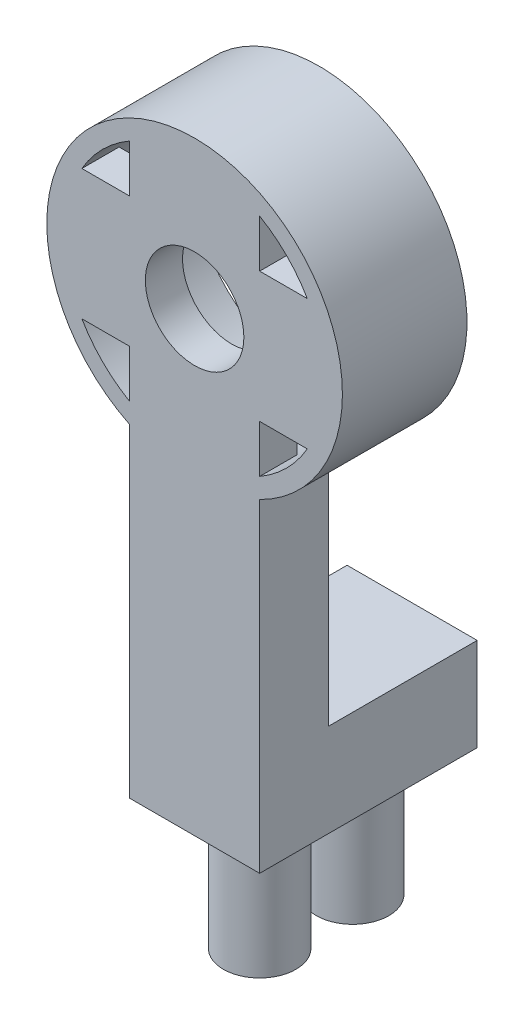
ISO-10303-21;
HEADER;
FILE_DESCRIPTION(('STEP AP214'),'2;1');
FILE_NAME('part.step','',(''),(''),'','','');
FILE_SCHEMA(('AUTOMOTIVE_DESIGN { 1 0 10303 214 1 1 1 1 }'));
ENDSEC;
DATA;
#1=APPLICATION_CONTEXT('core data for automotive mechanical design processes');
#2=APPLICATION_PROTOCOL_DEFINITION('international standard','automotive_design',2000,#1);
#3=PRODUCT_CONTEXT('',#1,'mechanical');
#4=PRODUCT('Part','Part','',(#3));
#5=PRODUCT_RELATED_PRODUCT_CATEGORY('part','',(#4));
#6=PRODUCT_DEFINITION_FORMATION('','',#4);
#7=PRODUCT_DEFINITION_CONTEXT('part definition',#1,'design');
#8=PRODUCT_DEFINITION('design','',#6,#7);
#9=PRODUCT_DEFINITION_SHAPE('','',#8);
#10=(LENGTH_UNIT() NAMED_UNIT(*) SI_UNIT(.MILLI.,.METRE.));
#11=(NAMED_UNIT(*) PLANE_ANGLE_UNIT() SI_UNIT($,.RADIAN.));
#12=(NAMED_UNIT(*) SI_UNIT($,.STERADIAN.) SOLID_ANGLE_UNIT());
#13=UNCERTAINTY_MEASURE_WITH_UNIT(LENGTH_MEASURE(1.E-05),#10,'distance_accuracy_value','');
#14=(GEOMETRIC_REPRESENTATION_CONTEXT(3) GLOBAL_UNCERTAINTY_ASSIGNED_CONTEXT((#13)) GLOBAL_UNIT_ASSIGNED_CONTEXT((#10,
#11,#12)) REPRESENTATION_CONTEXT('',''));
#15=CARTESIAN_POINT('',(0.,0.,0.));
#16=DIRECTION('',(0.,0.,1.));
#17=DIRECTION('',(1.,0.,0.));
#18=AXIS2_PLACEMENT_3D('',#15,#16,#17);
#19=CARTESIAN_POINT('',(0.,0.,3.));
#20=DIRECTION('',(0.,0.,-1.));
#21=DIRECTION('',(-1.,0.,0.));
#22=AXIS2_PLACEMENT_3D('',#19,#20,#21);
#23=CYLINDRICAL_SURFACE('',#22,7.95);
#24=CARTESIAN_POINT('',(0.,0.,-3.7));
#25=DIRECTION('',(0.,0.,-1.));
#26=DIRECTION('',(-1.,0.,0.));
#27=AXIS2_PLACEMENT_3D('',#24,#25,#26);
#28=CIRCLE('',#27,7.95);
#29=CARTESIAN_POINT('',(-7.95,0.,-3.7));
#30=VERTEX_POINT('',#29);
#31=EDGE_CURVE('E213',#30,#30,#28,.T.);
#32=ORIENTED_EDGE('',*,*,#31,.F.);
#33=EDGE_LOOP('',(#32));
#34=FACE_BOUND('',#33,.T.);
#35=DIRECTION('',(0.,0.,-1.));
#36=VECTOR('',#35,1.);
#37=CARTESIAN_POINT('',(3.5,-7.13810198862415,3.));
#38=LINE('',#37,#36);
#39=CARTESIAN_POINT('',(3.5,-7.13810198862415,3.));
#40=VERTEX_POINT('',#39);
#41=CARTESIAN_POINT('',(3.5,-7.13810198862415,-0.7));
#42=VERTEX_POINT('',#41);
#43=EDGE_CURVE('E342',#40,#42,#38,.T.);
#44=ORIENTED_EDGE('',*,*,#43,.T.);
#45=CARTESIAN_POINT('',(0.,0.,-0.7));
#46=DIRECTION('',(0.,0.,-1.));
#47=DIRECTION('',(-1.,0.,0.));
#48=AXIS2_PLACEMENT_3D('',#45,#46,#47);
#49=CIRCLE('',#48,7.95);
#50=CARTESIAN_POINT('',(-3.5,-7.13810198862415,-0.7));
#51=VERTEX_POINT('',#50);
#52=EDGE_CURVE('E199',#51,#42,#49,.F.);
#53=ORIENTED_EDGE('',*,*,#52,.F.);
#54=DIRECTION('',(0.,0.,-1.));
#55=VECTOR('',#54,1.);
#56=CARTESIAN_POINT('',(-3.5,-7.13810198862415,3.));
#57=LINE('',#56,#55);
#58=CARTESIAN_POINT('',(-3.5,-7.13810198862415,3.));
#59=VERTEX_POINT('',#58);
#60=EDGE_CURVE('E298',#59,#51,#57,.T.);
#61=ORIENTED_EDGE('',*,*,#60,.F.);
#62=CARTESIAN_POINT('',(0.,0.,3.));
#63=DIRECTION('',(0.,0.,1.));
#64=DIRECTION('',(1.,0.,0.));
#65=AXIS2_PLACEMENT_3D('',#62,#63,#64);
#66=CIRCLE('',#65,7.95);
#67=EDGE_CURVE('E255',#40,#59,#66,.T.);
#68=ORIENTED_EDGE('',*,*,#67,.F.);
#69=EDGE_LOOP('',(#44,#53,#61,#68));
#70=FACE_BOUND('',#69,.T.);
#71=ADVANCED_FACE('F47',(#34,#70),#23,.T.);
#72=CARTESIAN_POINT('',(0.,3.5,3.));
#73=DIRECTION('',(0.,1.,0.));
#74=DIRECTION('',(0.,0.,1.));
#75=AXIS2_PLACEMENT_3D('',#72,#73,#74);
#76=PLANE('',#75);
#77=DIRECTION('',(0.,0.,-1.));
#78=VECTOR('',#77,1.);
#79=CARTESIAN_POINT('',(6.06217782649107,3.5,3.));
#80=LINE('',#79,#78);
#81=CARTESIAN_POINT('',(6.06217782649107,3.5,3.));
#82=VERTEX_POINT('',#81);
#83=CARTESIAN_POINT('',(6.06217782649107,3.5,1.));
#84=VERTEX_POINT('',#83);
#85=EDGE_CURVE('E308',#82,#84,#80,.T.);
#86=ORIENTED_EDGE('',*,*,#85,.T.);
#87=DIRECTION('',(-1.,0.,0.));
#88=VECTOR('',#87,1.);
#89=CARTESIAN_POINT('',(0.,3.5,1.));
#90=LINE('',#89,#88);
#91=CARTESIAN_POINT('',(3.5,3.5,1.));
#92=VERTEX_POINT('',#91);
#93=EDGE_CURVE('E236',#84,#92,#90,.T.);
#94=ORIENTED_EDGE('',*,*,#93,.T.);
#95=DIRECTION('',(0.,0.,-1.));
#96=VECTOR('',#95,1.);
#97=CARTESIAN_POINT('',(3.5,3.5,3.));
#98=LINE('',#97,#96);
#99=CARTESIAN_POINT('',(3.5,3.5,3.));
#100=VERTEX_POINT('',#99);
#101=EDGE_CURVE('E303',#100,#92,#98,.T.);
#102=ORIENTED_EDGE('',*,*,#101,.F.);
#103=DIRECTION('',(1.,0.,0.));
#104=VECTOR('',#103,1.);
#105=CARTESIAN_POINT('',(0.,3.5,3.));
#106=LINE('',#105,#104);
#107=EDGE_CURVE('E292',#100,#82,#106,.T.);
#108=ORIENTED_EDGE('',*,*,#107,.T.);
#109=EDGE_LOOP('',(#86,#94,#102,#108));
#110=FACE_BOUND('',#109,.T.);
#111=ADVANCED_FACE('F410',(#110),#76,.T.);
#112=CARTESIAN_POINT('',(0.,3.5,3.));
#113=DIRECTION('',(0.,-1.,0.));
#114=DIRECTION('',(0.,0.,-1.));
#115=AXIS2_PLACEMENT_3D('',#112,#113,#114);
#116=PLANE('',#115);
#117=DIRECTION('',(1.,0.,0.));
#118=VECTOR('',#117,1.);
#119=CARTESIAN_POINT('',(0.,3.5,1.));
#120=LINE('',#119,#118);
#121=CARTESIAN_POINT('',(-6.06217782649107,3.5,1.));
#122=VERTEX_POINT('',#121);
#123=CARTESIAN_POINT('',(-3.5,3.5,1.));
#124=VERTEX_POINT('',#123);
#125=EDGE_CURVE('E230',#122,#124,#120,.T.);
#126=ORIENTED_EDGE('',*,*,#125,.F.);
#127=DIRECTION('',(0.,0.,-1.));
#128=VECTOR('',#127,1.);
#129=CARTESIAN_POINT('',(-6.06217782649107,3.5,3.));
#130=LINE('',#129,#128);
#131=CARTESIAN_POINT('',(-6.06217782649107,3.5,3.));
#132=VERTEX_POINT('',#131);
#133=EDGE_CURVE('E304',#132,#122,#130,.T.);
#134=ORIENTED_EDGE('',*,*,#133,.F.);
#135=DIRECTION('',(-1.,0.,0.));
#136=VECTOR('',#135,1.);
#137=CARTESIAN_POINT('',(0.,3.5,3.));
#138=LINE('',#137,#136);
#139=CARTESIAN_POINT('',(-3.5,3.5,3.));
#140=VERTEX_POINT('',#139);
#141=EDGE_CURVE('E280',#140,#132,#138,.T.);
#142=ORIENTED_EDGE('',*,*,#141,.F.);
#143=DIRECTION('',(0.,0.,-1.));
#144=VECTOR('',#143,1.);
#145=CARTESIAN_POINT('',(-3.5,3.5,3.));
#146=LINE('',#145,#144);
#147=EDGE_CURVE('E313',#140,#124,#146,.T.);
#148=ORIENTED_EDGE('',*,*,#147,.T.);
#149=EDGE_LOOP('',(#126,#134,#142,#148));
#150=FACE_BOUND('',#149,.T.);
#151=ADVANCED_FACE('F418',(#150),#116,.F.);
#152=CARTESIAN_POINT('',(0.,-3.5,3.));
#153=DIRECTION('',(0.,-1.,0.));
#154=DIRECTION('',(0.,0.,-1.));
#155=AXIS2_PLACEMENT_3D('',#152,#153,#154);
#156=PLANE('',#155);
#157=DIRECTION('',(0.,0.,-1.));
#158=VECTOR('',#157,1.);
#159=CARTESIAN_POINT('',(-6.06217782649107,-3.5,3.));
#160=LINE('',#159,#158);
#161=CARTESIAN_POINT('',(-6.06217782649107,-3.5,3.));
#162=VERTEX_POINT('',#161);
#163=CARTESIAN_POINT('',(-6.06217782649107,-3.5,1.));
#164=VERTEX_POINT('',#163);
#165=EDGE_CURVE('E325',#162,#164,#160,.T.);
#166=ORIENTED_EDGE('',*,*,#165,.T.);
#167=DIRECTION('',(1.,0.,0.));
#168=VECTOR('',#167,1.);
#169=CARTESIAN_POINT('',(0.,-3.5,1.));
#170=LINE('',#169,#168);
#171=CARTESIAN_POINT('',(-3.5,-3.5,1.));
#172=VERTEX_POINT('',#171);
#173=EDGE_CURVE('E243',#164,#172,#170,.T.);
#174=ORIENTED_EDGE('',*,*,#173,.T.);
#175=DIRECTION('',(0.,0.,-1.));
#176=VECTOR('',#175,1.);
#177=CARTESIAN_POINT('',(-3.5,-3.5,3.));
#178=LINE('',#177,#176);
#179=CARTESIAN_POINT('',(-3.5,-3.5,3.));
#180=VERTEX_POINT('',#179);
#181=EDGE_CURVE('E318',#180,#172,#178,.T.);
#182=ORIENTED_EDGE('',*,*,#181,.F.);
#183=DIRECTION('',(-1.,0.,0.));
#184=VECTOR('',#183,1.);
#185=CARTESIAN_POINT('',(0.,-3.5,3.));
#186=LINE('',#185,#184);
#187=EDGE_CURVE('E269',#180,#162,#186,.T.);
#188=ORIENTED_EDGE('',*,*,#187,.T.);
#189=EDGE_LOOP('',(#166,#174,#182,#188));
#190=FACE_BOUND('',#189,.T.);
#191=ADVANCED_FACE('F454',(#190),#156,.T.);
#192=CARTESIAN_POINT('',(-3.5,0.,3.));
#193=DIRECTION('',(1.,0.,0.));
#194=DIRECTION('',(0.,0.,-1.));
#195=AXIS2_PLACEMENT_3D('',#192,#193,#194);
#196=PLANE('',#195);
#197=DIRECTION('',(0.,1.,0.));
#198=VECTOR('',#197,1.);
#199=CARTESIAN_POINT('',(-3.5,0.,1.));
#200=LINE('',#199,#198);
#201=CARTESIAN_POINT('',(-3.5,-6.06217782649107,1.));
#202=VERTEX_POINT('',#201);
#203=EDGE_CURVE('E240',#202,#172,#200,.T.);
#204=ORIENTED_EDGE('',*,*,#203,.F.);
#205=DIRECTION('',(0.,0.,-1.));
#206=VECTOR('',#205,1.);
#207=CARTESIAN_POINT('',(-3.5,-6.06217782649107,3.));
#208=LINE('',#207,#206);
#209=CARTESIAN_POINT('',(-3.5,-6.06217782649107,3.));
#210=VERTEX_POINT('',#209);
#211=EDGE_CURVE('E329',#210,#202,#208,.T.);
#212=ORIENTED_EDGE('',*,*,#211,.F.);
#213=DIRECTION('',(0.,-1.,0.));
#214=VECTOR('',#213,1.);
#215=CARTESIAN_POINT('',(-3.5,0.,3.));
#216=LINE('',#215,#214);
#217=EDGE_CURVE('E273',#180,#210,#216,.T.);
#218=ORIENTED_EDGE('',*,*,#217,.F.);
#219=ORIENTED_EDGE('',*,*,#181,.T.);
#220=EDGE_LOOP('',(#204,#212,#218,#219));
#221=FACE_BOUND('',#220,.T.);
#222=ADVANCED_FACE('F456',(#221),#196,.F.);
#223=CARTESIAN_POINT('',(3.5,0.,3.));
#224=DIRECTION('',(1.,0.,0.));
#225=DIRECTION('',(0.,1.,0.));
#226=AXIS2_PLACEMENT_3D('',#223,#224,#225);
#227=PLANE('',#226);
#228=DIRECTION('',(0.,0.,-1.));
#229=VECTOR('',#228,1.);
#230=CARTESIAN_POINT('',(3.5,-6.06217782649107,3.));
#231=LINE('',#230,#229);
#232=CARTESIAN_POINT('',(3.5,-6.06217782649107,3.));
#233=VERTEX_POINT('',#232);
#234=CARTESIAN_POINT('',(3.5,-6.06217782649107,1.));
#235=VERTEX_POINT('',#234);
#236=EDGE_CURVE('E330',#233,#235,#231,.T.);
#237=ORIENTED_EDGE('',*,*,#236,.T.);
#238=DIRECTION('',(0.,1.,0.));
#239=VECTOR('',#238,1.);
#240=CARTESIAN_POINT('',(3.5,0.,1.));
#241=LINE('',#240,#239);
#242=CARTESIAN_POINT('',(3.5,-3.5,1.));
#243=VERTEX_POINT('',#242);
#244=EDGE_CURVE('E222',#235,#243,#241,.T.);
#245=ORIENTED_EDGE('',*,*,#244,.T.);
#246=DIRECTION('',(0.,0.,-1.));
#247=VECTOR('',#246,1.);
#248=CARTESIAN_POINT('',(3.5,-3.5,3.));
#249=LINE('',#248,#247);
#250=CARTESIAN_POINT('',(3.5,-3.5,3.));
#251=VERTEX_POINT('',#250);
#252=EDGE_CURVE('E341',#251,#243,#249,.T.);
#253=ORIENTED_EDGE('',*,*,#252,.F.);
#254=DIRECTION('',(0.,-1.,0.));
#255=VECTOR('',#254,1.);
#256=CARTESIAN_POINT('',(3.5,0.,3.));
#257=LINE('',#256,#255);
#258=EDGE_CURVE('E262',#251,#233,#257,.T.);
#259=ORIENTED_EDGE('',*,*,#258,.T.);
#260=EDGE_LOOP('',(#237,#245,#253,#259));
#261=FACE_BOUND('',#260,.T.);
#262=ADVANCED_FACE('F423',(#261),#227,.T.);
#263=CARTESIAN_POINT('',(3.5,0.,3.));
#264=DIRECTION('',(-1.,0.,0.));
#265=DIRECTION('',(0.,0.,1.));
#266=AXIS2_PLACEMENT_3D('',#263,#264,#265);
#267=PLANE('',#266);
#268=DIRECTION('',(0.,-1.,0.));
#269=VECTOR('',#268,1.);
#270=CARTESIAN_POINT('',(3.5,0.,1.));
#271=LINE('',#270,#269);
#272=CARTESIAN_POINT('',(3.5,6.06217782649107,1.));
#273=VERTEX_POINT('',#272);
#274=EDGE_CURVE('E233',#273,#92,#271,.T.);
#275=ORIENTED_EDGE('',*,*,#274,.F.);
#276=DIRECTION('',(0.,0.,-1.));
#277=VECTOR('',#276,1.);
#278=CARTESIAN_POINT('',(3.5,6.06217782649107,3.));
#279=LINE('',#278,#277);
#280=CARTESIAN_POINT('',(3.5,6.06217782649107,3.));
#281=VERTEX_POINT('',#280);
#282=EDGE_CURVE('E299',#281,#273,#279,.T.);
#283=ORIENTED_EDGE('',*,*,#282,.F.);
#284=DIRECTION('',(0.,1.,0.));
#285=VECTOR('',#284,1.);
#286=CARTESIAN_POINT('',(3.5,0.,3.));
#287=LINE('',#286,#285);
#288=EDGE_CURVE('E72',#100,#281,#287,.T.);
#289=ORIENTED_EDGE('',*,*,#288,.F.);
#290=ORIENTED_EDGE('',*,*,#101,.T.);
#291=EDGE_LOOP('',(#275,#283,#289,#290));
#292=FACE_BOUND('',#291,.T.);
#293=ADVANCED_FACE('F450',(#292),#267,.F.);
#294=CARTESIAN_POINT('',(-3.5,0.,3.));
#295=DIRECTION('',(-1.,0.,0.));
#296=DIRECTION('',(0.,0.,1.));
#297=AXIS2_PLACEMENT_3D('',#294,#295,#296);
#298=PLANE('',#297);
#299=DIRECTION('',(0.,0.,-1.));
#300=VECTOR('',#299,1.);
#301=CARTESIAN_POINT('',(-3.5,6.06217782649107,3.));
#302=LINE('',#301,#300);
#303=CARTESIAN_POINT('',(-3.5,6.06217782649107,3.));
#304=VERTEX_POINT('',#303);
#305=CARTESIAN_POINT('',(-3.5,6.06217782649107,1.));
#306=VERTEX_POINT('',#305);
#307=EDGE_CURVE('E317',#304,#306,#302,.T.);
#308=ORIENTED_EDGE('',*,*,#307,.T.);
#309=DIRECTION('',(0.,-1.,0.));
#310=VECTOR('',#309,1.);
#311=CARTESIAN_POINT('',(-3.5,0.,1.));
#312=LINE('',#311,#310);
#313=EDGE_CURVE('E226',#306,#124,#312,.T.);
#314=ORIENTED_EDGE('',*,*,#313,.T.);
#315=ORIENTED_EDGE('',*,*,#147,.F.);
#316=DIRECTION('',(0.,1.,0.));
#317=VECTOR('',#316,1.);
#318=CARTESIAN_POINT('',(-3.5,0.,3.));
#319=LINE('',#318,#317);
#320=EDGE_CURVE('E287',#140,#304,#319,.T.);
#321=ORIENTED_EDGE('',*,*,#320,.T.);
#322=EDGE_LOOP('',(#308,#314,#315,#321));
#323=FACE_BOUND('',#322,.T.);
#324=ADVANCED_FACE('F442',(#323),#298,.T.);
#325=CARTESIAN_POINT('',(0.,-3.5,3.));
#326=DIRECTION('',(0.,1.,0.));
#327=DIRECTION('',(0.,0.,1.));
#328=AXIS2_PLACEMENT_3D('',#325,#326,#327);
#329=PLANE('',#328);
#330=DIRECTION('',(-1.,0.,0.));
#331=VECTOR('',#330,1.);
#332=CARTESIAN_POINT('',(0.,-3.5,1.));
#333=LINE('',#332,#331);
#334=CARTESIAN_POINT('',(6.06217782649107,-3.5,1.));
#335=VERTEX_POINT('',#334);
#336=EDGE_CURVE('E312',#335,#243,#333,.T.);
#337=ORIENTED_EDGE('',*,*,#336,.F.);
#338=DIRECTION('',(0.,0.,-1.));
#339=VECTOR('',#338,1.);
#340=CARTESIAN_POINT('',(6.06217782649107,-3.5,3.));
#341=LINE('',#340,#339);
#342=CARTESIAN_POINT('',(6.06217782649107,-3.5,3.));
#343=VERTEX_POINT('',#342);
#344=EDGE_CURVE('E337',#343,#335,#341,.T.);
#345=ORIENTED_EDGE('',*,*,#344,.F.);
#346=DIRECTION('',(1.,0.,0.));
#347=VECTOR('',#346,1.);
#348=CARTESIAN_POINT('',(0.,-3.5,3.));
#349=LINE('',#348,#347);
#350=EDGE_CURVE('E266',#251,#343,#349,.T.);
#351=ORIENTED_EDGE('',*,*,#350,.F.);
#352=ORIENTED_EDGE('',*,*,#252,.T.);
#353=EDGE_LOOP('',(#337,#345,#351,#352));
#354=FACE_BOUND('',#353,.T.);
#355=ADVANCED_FACE('F436',(#354),#329,.F.);
#356=CARTESIAN_POINT('',(0.,0.,3.));
#357=DIRECTION('',(0.,0.,-1.));
#358=DIRECTION('',(-1.,0.,0.));
#359=AXIS2_PLACEMENT_3D('',#356,#357,#358);
#360=CYLINDRICAL_SURFACE('',#359,7.);
#361=CARTESIAN_POINT('',(0.,0.,1.));
#362=DIRECTION('',(0.,0.,-1.));
#363=DIRECTION('',(-1.,0.,0.));
#364=AXIS2_PLACEMENT_3D('',#361,#362,#363);
#365=CIRCLE('',#364,7.);
#366=EDGE_CURVE('E477',#84,#335,#365,.T.);
#367=ORIENTED_EDGE('',*,*,#366,.F.);
#368=ORIENTED_EDGE('',*,*,#85,.F.);
#369=CARTESIAN_POINT('',(0.,0.,3.));
#370=DIRECTION('',(0.,0.,1.));
#371=DIRECTION('',(1.,0.,0.));
#372=AXIS2_PLACEMENT_3D('',#369,#370,#371);
#373=CIRCLE('',#372,7.);
#374=EDGE_CURVE('E288',#82,#281,#373,.T.);
#375=ORIENTED_EDGE('',*,*,#374,.T.);
#376=ORIENTED_EDGE('',*,*,#282,.T.);
#377=EDGE_CURVE('E221',#306,#273,#365,.T.);
#378=ORIENTED_EDGE('',*,*,#377,.F.);
#379=ORIENTED_EDGE('',*,*,#307,.F.);
#380=EDGE_CURVE('E283',#304,#132,#373,.T.);
#381=ORIENTED_EDGE('',*,*,#380,.T.);
#382=ORIENTED_EDGE('',*,*,#133,.T.);
#383=EDGE_CURVE('E217',#164,#122,#365,.T.);
#384=ORIENTED_EDGE('',*,*,#383,.F.);
#385=ORIENTED_EDGE('',*,*,#165,.F.);
#386=CARTESIAN_POINT('',(0.,0.,3.));
#387=DIRECTION('',(0.,0.,1.));
#388=DIRECTION('',(1.,0.,0.));
#389=AXIS2_PLACEMENT_3D('',#386,#387,#388);
#390=CIRCLE('',#389,7.);
#391=EDGE_CURVE('E276',#162,#210,#390,.T.);
#392=ORIENTED_EDGE('',*,*,#391,.T.);
#393=ORIENTED_EDGE('',*,*,#211,.T.);
#394=EDGE_CURVE('E220',#235,#202,#365,.T.);
#395=ORIENTED_EDGE('',*,*,#394,.F.);
#396=ORIENTED_EDGE('',*,*,#236,.F.);
#397=CARTESIAN_POINT('',(0.,0.,3.));
#398=DIRECTION('',(0.,0.,1.));
#399=DIRECTION('',(1.,0.,0.));
#400=AXIS2_PLACEMENT_3D('',#397,#398,#399);
#401=CIRCLE('',#400,7.);
#402=EDGE_CURVE('E258',#233,#343,#401,.T.);
#403=ORIENTED_EDGE('',*,*,#402,.T.);
#404=ORIENTED_EDGE('',*,*,#344,.T.);
#405=EDGE_LOOP('',(#367,#368,#375,#376,#378,#379,#381,#382,#384,#385,#392,#393,#395,#396,#403,#404));
#406=FACE_BOUND('',#405,.T.);
#407=CARTESIAN_POINT('',(0.,0.,-3.7));
#408=DIRECTION('',(0.,0.,-1.));
#409=DIRECTION('',(-1.,0.,0.));
#410=AXIS2_PLACEMENT_3D('',#407,#408,#409);
#411=CIRCLE('',#410,7.);
#412=CARTESIAN_POINT('',(-7.,0.,-3.7));
#413=VERTEX_POINT('',#412);
#414=EDGE_CURVE('E204',#413,#413,#411,.T.);
#415=ORIENTED_EDGE('',*,*,#414,.T.);
#416=EDGE_LOOP('',(#415));
#417=FACE_BOUND('',#416,.T.);
#418=ADVANCED_FACE('F432',(#406,#417),#360,.F.);
#419=CARTESIAN_POINT('',(-3.5,0.,3.));
#420=DIRECTION('',(1.,0.,0.));
#421=DIRECTION('',(0.,0.,-1.));
#422=AXIS2_PLACEMENT_3D('',#419,#420,#421);
#423=PLANE('',#422);
#424=DIRECTION('',(0.,1.,0.));
#425=VECTOR('',#424,1.);
#426=CARTESIAN_POINT('',(-3.5,0.,-0.7));
#427=LINE('',#426,#425);
#428=CARTESIAN_POINT('',(-3.5,-19.55,-0.7));
#429=VERTEX_POINT('',#428);
#430=EDGE_CURVE('E64',#429,#51,#427,.T.);
#431=ORIENTED_EDGE('',*,*,#430,.F.);
#432=DIRECTION('',(0.,0.,-1.));
#433=VECTOR('',#432,1.);
#434=CARTESIAN_POINT('',(-3.5,-19.55,-0.7));
#435=LINE('',#434,#433);
#436=CARTESIAN_POINT('',(-3.5,-19.55,-8.7));
#437=VERTEX_POINT('',#436);
#438=EDGE_CURVE('E184',#429,#437,#435,.T.);
#439=ORIENTED_EDGE('',*,*,#438,.T.);
#440=DIRECTION('',(0.,-1.,0.));
#441=VECTOR('',#440,1.);
#442=CARTESIAN_POINT('',(-3.5,-19.55,-8.7));
#443=LINE('',#442,#441);
#444=CARTESIAN_POINT('',(-3.5,-24.55,-8.7));
#445=VERTEX_POINT('',#444);
#446=EDGE_CURVE('E378',#437,#445,#443,.T.);
#447=ORIENTED_EDGE('',*,*,#446,.T.);
#448=DIRECTION('',(0.,0.,1.));
#449=VECTOR('',#448,1.);
#450=CARTESIAN_POINT('',(-3.5,-24.55,3.));
#451=LINE('',#450,#449);
#452=CARTESIAN_POINT('',(-3.5,-24.55,3.));
#453=VERTEX_POINT('',#452);
#454=EDGE_CURVE('E370',#445,#453,#451,.T.);
#455=ORIENTED_EDGE('',*,*,#454,.T.);
#456=DIRECTION('',(0.,-1.,0.));
#457=VECTOR('',#456,1.);
#458=CARTESIAN_POINT('',(-3.5,0.,3.));
#459=LINE('',#458,#457);
#460=EDGE_CURVE('E247',#59,#453,#459,.T.);
#461=ORIENTED_EDGE('',*,*,#460,.F.);
#462=ORIENTED_EDGE('',*,*,#60,.T.);
#463=EDGE_LOOP('',(#431,#439,#447,#455,#461,#462));
#464=FACE_BOUND('',#463,.T.);
#465=ADVANCED_FACE('F49',(#464),#423,.F.);
#466=CARTESIAN_POINT('',(3.5,0.,3.));
#467=DIRECTION('',(1.,0.,0.));
#468=DIRECTION('',(0.,1.,0.));
#469=AXIS2_PLACEMENT_3D('',#466,#467,#468);
#470=PLANE('',#469);
#471=DIRECTION('',(0.,0.,1.));
#472=VECTOR('',#471,1.);
#473=CARTESIAN_POINT('',(3.5,-24.55,3.));
#474=LINE('',#473,#472);
#475=CARTESIAN_POINT('',(3.50000000000001,-24.55,-8.7));
#476=VERTEX_POINT('',#475);
#477=CARTESIAN_POINT('',(3.5,-24.55,3.));
#478=VERTEX_POINT('',#477);
#479=EDGE_CURVE('E372',#476,#478,#474,.T.);
#480=ORIENTED_EDGE('',*,*,#479,.F.);
#481=DIRECTION('',(0.,-1.,0.));
#482=VECTOR('',#481,1.);
#483=CARTESIAN_POINT('',(3.50000000000001,-19.55,-8.7));
#484=LINE('',#483,#482);
#485=CARTESIAN_POINT('',(3.50000000000001,-19.55,-8.7));
#486=VERTEX_POINT('',#485);
#487=EDGE_CURVE('E193',#486,#476,#484,.T.);
#488=ORIENTED_EDGE('',*,*,#487,.F.);
#489=DIRECTION('',(0.,0.,1.));
#490=VECTOR('',#489,1.);
#491=CARTESIAN_POINT('',(3.50000000000001,-19.55,-0.7));
#492=LINE('',#491,#490);
#493=CARTESIAN_POINT('',(3.50000000000001,-19.55,-0.7));
#494=VERTEX_POINT('',#493);
#495=EDGE_CURVE('E181',#486,#494,#492,.T.);
#496=ORIENTED_EDGE('',*,*,#495,.T.);
#497=DIRECTION('',(0.,-1.,0.));
#498=VECTOR('',#497,1.);
#499=CARTESIAN_POINT('',(3.5,0.,-0.7));
#500=LINE('',#499,#498);
#501=EDGE_CURVE('E191',#42,#494,#500,.T.);
#502=ORIENTED_EDGE('',*,*,#501,.F.);
#503=ORIENTED_EDGE('',*,*,#43,.F.);
#504=DIRECTION('',(0.,-1.,0.));
#505=VECTOR('',#504,1.);
#506=CARTESIAN_POINT('',(3.5,0.,3.));
#507=LINE('',#506,#505);
#508=EDGE_CURVE('E251',#40,#478,#507,.T.);
#509=ORIENTED_EDGE('',*,*,#508,.T.);
#510=EDGE_LOOP('',(#480,#488,#496,#502,#503,#509));
#511=FACE_BOUND('',#510,.T.);
#512=ADVANCED_FACE('F190',(#511),#470,.T.);
#513=CARTESIAN_POINT('',(0.,0.,3.));
#514=DIRECTION('',(0.,0.,1.));
#515=DIRECTION('',(1.,0.,0.));
#516=AXIS2_PLACEMENT_3D('',#513,#514,#515);
#517=PLANE('',#516);
#518=CARTESIAN_POINT('',(0.,0.,3.));
#519=DIRECTION('',(0.,0.,1.));
#520=DIRECTION('',(1.,0.,0.));
#521=AXIS2_PLACEMENT_3D('',#518,#519,#520);
#522=CIRCLE('',#521,2.65);
#523=CARTESIAN_POINT('',(2.65,0.,3.));
#524=VERTEX_POINT('',#523);
#525=EDGE_CURVE('E980',#524,#524,#522,.T.);
#526=ORIENTED_EDGE('',*,*,#525,.F.);
#527=EDGE_LOOP('',(#526));
#528=FACE_BOUND('',#527,.T.);
#529=DIRECTION('',(-1.,0.,0.));
#530=VECTOR('',#529,1.);
#531=CARTESIAN_POINT('',(0.,-24.55,3.));
#532=LINE('',#531,#530);
#533=EDGE_CURVE('E206',#478,#453,#532,.T.);
#534=ORIENTED_EDGE('',*,*,#533,.F.);
#535=ORIENTED_EDGE('',*,*,#508,.F.);
#536=ORIENTED_EDGE('',*,*,#67,.T.);
#537=ORIENTED_EDGE('',*,*,#460,.T.);
#538=EDGE_LOOP('',(#534,#535,#536,#537));
#539=FACE_BOUND('',#538,.T.);
#540=ORIENTED_EDGE('',*,*,#402,.F.);
#541=ORIENTED_EDGE('',*,*,#258,.F.);
#542=ORIENTED_EDGE('',*,*,#350,.T.);
#543=EDGE_LOOP('',(#540,#541,#542));
#544=FACE_BOUND('',#543,.T.);
#545=ORIENTED_EDGE('',*,*,#187,.F.);
#546=ORIENTED_EDGE('',*,*,#217,.T.);
#547=ORIENTED_EDGE('',*,*,#391,.F.);
#548=EDGE_LOOP('',(#545,#546,#547));
#549=FACE_BOUND('',#548,.T.);
#550=ORIENTED_EDGE('',*,*,#141,.T.);
#551=ORIENTED_EDGE('',*,*,#380,.F.);
#552=ORIENTED_EDGE('',*,*,#320,.F.);
#553=EDGE_LOOP('',(#550,#551,#552));
#554=FACE_BOUND('',#553,.T.);
#555=ORIENTED_EDGE('',*,*,#374,.F.);
#556=ORIENTED_EDGE('',*,*,#107,.F.);
#557=ORIENTED_EDGE('',*,*,#288,.T.);
#558=EDGE_LOOP('',(#555,#556,#557));
#559=FACE_BOUND('',#558,.T.);
#560=ADVANCED_FACE('F382',(#528,#539,#544,#549,#554,#559),#517,.T.);
#561=CARTESIAN_POINT('',(0.,0.,1.));
#562=DIRECTION('',(0.,0.,-1.));
#563=DIRECTION('',(-1.,0.,0.));
#564=AXIS2_PLACEMENT_3D('',#561,#562,#563);
#565=PLANE('',#564);
#566=CARTESIAN_POINT('',(0.,0.,1.));
#567=DIRECTION('',(0.,0.,-1.));
#568=DIRECTION('',(-1.,0.,0.));
#569=AXIS2_PLACEMENT_3D('',#566,#567,#568);
#570=CIRCLE('',#569,2.65);
#571=CARTESIAN_POINT('',(-2.65,0.,1.));
#572=VERTEX_POINT('',#571);
#573=EDGE_CURVE('E51',#572,#572,#570,.T.);
#574=ORIENTED_EDGE('',*,*,#573,.F.);
#575=EDGE_LOOP('',(#574));
#576=FACE_BOUND('',#575,.T.);
#577=ORIENTED_EDGE('',*,*,#383,.T.);
#578=ORIENTED_EDGE('',*,*,#125,.T.);
#579=ORIENTED_EDGE('',*,*,#313,.F.);
#580=ORIENTED_EDGE('',*,*,#377,.T.);
#581=ORIENTED_EDGE('',*,*,#274,.T.);
#582=ORIENTED_EDGE('',*,*,#93,.F.);
#583=ORIENTED_EDGE('',*,*,#366,.T.);
#584=ORIENTED_EDGE('',*,*,#336,.T.);
#585=ORIENTED_EDGE('',*,*,#244,.F.);
#586=ORIENTED_EDGE('',*,*,#394,.T.);
#587=ORIENTED_EDGE('',*,*,#203,.T.);
#588=ORIENTED_EDGE('',*,*,#173,.F.);
#589=EDGE_LOOP('',(#577,#578,#579,#580,#581,#582,#583,#584,#585,#586,#587,#588));
#590=FACE_BOUND('',#589,.T.);
#591=ADVANCED_FACE('F429',(#576,#590),#565,.T.);
#592=CARTESIAN_POINT('',(0.,0.,-3.7));
#593=DIRECTION('',(0.,0.,-1.));
#594=DIRECTION('',(-1.,0.,0.));
#595=AXIS2_PLACEMENT_3D('',#592,#593,#594);
#596=PLANE('',#595);
#597=ORIENTED_EDGE('',*,*,#31,.T.);
#598=EDGE_LOOP('',(#597));
#599=FACE_BOUND('',#598,.T.);
#600=ORIENTED_EDGE('',*,*,#414,.F.);
#601=EDGE_LOOP('',(#600));
#602=FACE_BOUND('',#601,.T.);
#603=ADVANCED_FACE('F503',(#599,#602),#596,.T.);
#604=CARTESIAN_POINT('',(0.,0.,-0.7));
#605=DIRECTION('',(0.,0.,-1.));
#606=DIRECTION('',(-1.,0.,0.));
#607=AXIS2_PLACEMENT_3D('',#604,#605,#606);
#608=PLANE('',#607);
#609=DIRECTION('',(-1.,0.,0.));
#610=VECTOR('',#609,1.);
#611=CARTESIAN_POINT('',(3.50000000000001,-19.55,-0.7));
#612=LINE('',#611,#610);
#613=EDGE_CURVE('E177',#494,#429,#612,.T.);
#614=ORIENTED_EDGE('',*,*,#613,.T.);
#615=ORIENTED_EDGE('',*,*,#430,.T.);
#616=ORIENTED_EDGE('',*,*,#52,.T.);
#617=ORIENTED_EDGE('',*,*,#501,.T.);
#618=EDGE_LOOP('',(#614,#615,#616,#617));
#619=FACE_BOUND('',#618,.T.);
#620=ADVANCED_FACE('F197',(#619),#608,.T.);
#621=CARTESIAN_POINT('',(11.0264586984366,-24.55,7.3));
#622=DIRECTION('',(0.,1.,0.));
#623=DIRECTION('',(0.,0.,1.));
#624=AXIS2_PLACEMENT_3D('',#621,#622,#623);
#625=PLANE('',#624);
#626=CARTESIAN_POINT('',(0.,-24.55,-0.500000000000001));
#627=DIRECTION('',(0.,1.,0.));
#628=DIRECTION('',(0.,0.,1.));
#629=AXIS2_PLACEMENT_3D('',#626,#627,#628);
#630=CIRCLE('',#629,1.95);
#631=CARTESIAN_POINT('',(0.,-24.55,1.45));
#632=VERTEX_POINT('',#631);
#633=EDGE_CURVE('E11',#632,#632,#630,.F.);
#634=ORIENTED_EDGE('',*,*,#633,.F.);
#635=EDGE_LOOP('',(#634));
#636=FACE_BOUND('',#635,.T.);
#637=CARTESIAN_POINT('',(0.,-24.55,-5.5));
#638=DIRECTION('',(0.,1.,0.));
#639=DIRECTION('',(0.,0.,1.));
#640=AXIS2_PLACEMENT_3D('',#637,#638,#639);
#641=CIRCLE('',#640,1.95);
#642=CARTESIAN_POINT('',(0.,-24.55,-3.55));
#643=VERTEX_POINT('',#642);
#644=EDGE_CURVE('E57',#643,#643,#641,.F.);
#645=ORIENTED_EDGE('',*,*,#644,.F.);
#646=EDGE_LOOP('',(#645));
#647=FACE_BOUND('',#646,.T.);
#648=ORIENTED_EDGE('',*,*,#533,.T.);
#649=ORIENTED_EDGE('',*,*,#454,.F.);
#650=DIRECTION('',(1.,0.,0.));
#651=VECTOR('',#650,1.);
#652=CARTESIAN_POINT('',(3.50000000000001,-24.55,-8.7));
#653=LINE('',#652,#651);
#654=EDGE_CURVE('E195',#445,#476,#653,.T.);
#655=ORIENTED_EDGE('',*,*,#654,.T.);
#656=ORIENTED_EDGE('',*,*,#479,.T.);
#657=EDGE_LOOP('',(#648,#649,#655,#656));
#658=FACE_BOUND('',#657,.T.);
#659=ADVANCED_FACE('F361',(#636,#647,#658),#625,.F.);
#660=CARTESIAN_POINT('',(3.50000000000001,-19.55,-8.7));
#661=DIRECTION('',(0.,0.,-1.));
#662=DIRECTION('',(-1.,0.,0.));
#663=AXIS2_PLACEMENT_3D('',#660,#661,#662);
#664=PLANE('',#663);
#665=ORIENTED_EDGE('',*,*,#654,.F.);
#666=ORIENTED_EDGE('',*,*,#446,.F.);
#667=DIRECTION('',(1.,0.,0.));
#668=VECTOR('',#667,1.);
#669=CARTESIAN_POINT('',(3.50000000000001,-19.55,-8.7));
#670=LINE('',#669,#668);
#671=EDGE_CURVE('E388',#437,#486,#670,.T.);
#672=ORIENTED_EDGE('',*,*,#671,.T.);
#673=ORIENTED_EDGE('',*,*,#487,.T.);
#674=EDGE_LOOP('',(#665,#666,#672,#673));
#675=FACE_BOUND('',#674,.T.);
#676=ADVANCED_FACE('F364',(#675),#664,.T.);
#677=CARTESIAN_POINT('',(0.,-19.55,0.));
#678=DIRECTION('',(0.,1.,0.));
#679=DIRECTION('',(0.,0.,1.));
#680=AXIS2_PLACEMENT_3D('',#677,#678,#679);
#681=PLANE('',#680);
#682=ORIENTED_EDGE('',*,*,#495,.F.);
#683=ORIENTED_EDGE('',*,*,#671,.F.);
#684=ORIENTED_EDGE('',*,*,#438,.F.);
#685=ORIENTED_EDGE('',*,*,#613,.F.);
#686=EDGE_LOOP('',(#682,#683,#684,#685));
#687=FACE_BOUND('',#686,.T.);
#688=ADVANCED_FACE('F179',(#687),#681,.T.);
#689=CARTESIAN_POINT('',(0.,-31.55,-5.5));
#690=DIRECTION('',(0.,1.,0.));
#691=DIRECTION('',(0.,0.,1.));
#692=AXIS2_PLACEMENT_3D('',#689,#690,#691);
#693=CYLINDRICAL_SURFACE('',#692,1.95);
#694=CARTESIAN_POINT('',(0.,-31.55,-5.5));
#695=DIRECTION('',(0.,-1.,0.));
#696=DIRECTION('',(0.,0.,-1.));
#697=AXIS2_PLACEMENT_3D('',#694,#695,#696);
#698=CIRCLE('',#697,1.95);
#699=CARTESIAN_POINT('',(0.,-31.55,-7.45));
#700=VERTEX_POINT('',#699);
#701=EDGE_CURVE('E398',#700,#700,#698,.T.);
#702=ORIENTED_EDGE('',*,*,#701,.F.);
#703=EDGE_LOOP('',(#702));
#704=FACE_BOUND('',#703,.T.);
#705=ORIENTED_EDGE('',*,*,#644,.T.);
#706=EDGE_LOOP('',(#705));
#707=FACE_BOUND('',#706,.T.);
#708=ADVANCED_FACE('F359',(#704,#707),#693,.T.);
#709=CARTESIAN_POINT('',(0.,-31.55,-5.5));
#710=DIRECTION('',(0.,-1.,0.));
#711=DIRECTION('',(0.,0.,-1.));
#712=AXIS2_PLACEMENT_3D('',#709,#710,#711);
#713=PLANE('',#712);
#714=ORIENTED_EDGE('',*,*,#701,.T.);
#715=EDGE_LOOP('',(#714));
#716=FACE_BOUND('',#715,.T.);
#717=ADVANCED_FACE('F939',(#716),#713,.T.);
#718=CARTESIAN_POINT('',(0.,-31.55,-0.500000000000001));
#719=DIRECTION('',(0.,1.,0.));
#720=DIRECTION('',(0.,0.,1.));
#721=AXIS2_PLACEMENT_3D('',#718,#719,#720);
#722=CYLINDRICAL_SURFACE('',#721,1.95);
#723=CARTESIAN_POINT('',(0.,-31.55,-0.500000000000001));
#724=DIRECTION('',(0.,-1.,0.));
#725=DIRECTION('',(0.,0.,-1.));
#726=AXIS2_PLACEMENT_3D('',#723,#724,#725);
#727=CIRCLE('',#726,1.95);
#728=CARTESIAN_POINT('',(0.,-31.55,-2.45));
#729=VERTEX_POINT('',#728);
#730=EDGE_CURVE('E974',#729,#729,#727,.T.);
#731=ORIENTED_EDGE('',*,*,#730,.F.);
#732=EDGE_LOOP('',(#731));
#733=FACE_BOUND('',#732,.T.);
#734=ORIENTED_EDGE('',*,*,#633,.T.);
#735=EDGE_LOOP('',(#734));
#736=FACE_BOUND('',#735,.T.);
#737=ADVANCED_FACE('F929',(#733,#736),#722,.T.);
#738=CARTESIAN_POINT('',(0.,-31.55,-0.500000000000001));
#739=DIRECTION('',(0.,-1.,0.));
#740=DIRECTION('',(0.,0.,-1.));
#741=AXIS2_PLACEMENT_3D('',#738,#739,#740);
#742=PLANE('',#741);
#743=ORIENTED_EDGE('',*,*,#730,.T.);
#744=EDGE_LOOP('',(#743));
#745=FACE_BOUND('',#744,.T.);
#746=ADVANCED_FACE('F917',(#745),#742,.T.);
#747=CARTESIAN_POINT('',(0.,0.,-7.));
#748=DIRECTION('',(0.,0.,1.));
#749=DIRECTION('',(1.,0.,0.));
#750=AXIS2_PLACEMENT_3D('',#747,#748,#749);
#751=CYLINDRICAL_SURFACE('',#750,2.65);
#752=ORIENTED_EDGE('',*,*,#573,.T.);
#753=EDGE_LOOP('',(#752));
#754=FACE_BOUND('',#753,.T.);
#755=ORIENTED_EDGE('',*,*,#525,.T.);
#756=EDGE_LOOP('',(#755));
#757=FACE_BOUND('',#756,.T.);
#758=ADVANCED_FACE('F914',(#754,#757),#751,.F.);
#759=CLOSED_SHELL('',(#71,#111,#151,#191,#222,#262,#293,#324,#355,#418,#465,#512,#560,#591,#603,
#620,#659,#676,#688,#708,#717,#737,#746,#758));
#760=MANIFOLD_SOLID_BREP('B2',#759);
#761=ADVANCED_BREP_SHAPE_REPRESENTATION('',(#18,#760),#14);
#762=SHAPE_DEFINITION_REPRESENTATION(#9,#761);
ENDSEC;
END-ISO-10303-21;
